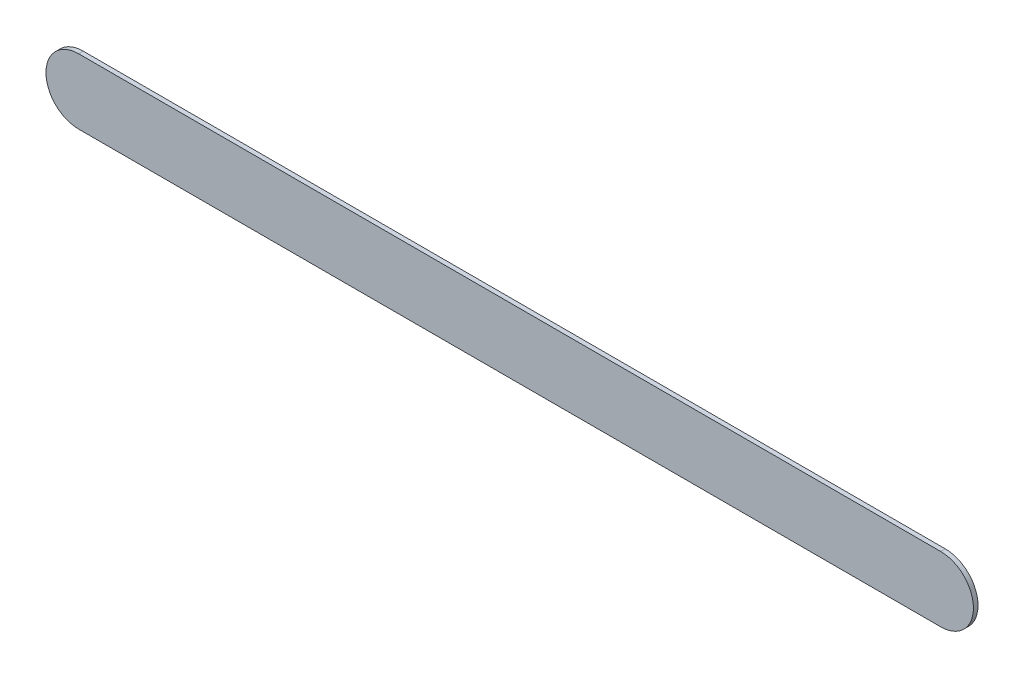
ISO-10303-21;
HEADER;
FILE_DESCRIPTION(('STEP AP214'),'2;1');
FILE_NAME('part.step','',(''),(''),'','','');
FILE_SCHEMA(('AUTOMOTIVE_DESIGN { 1 0 10303 214 1 1 1 1 }'));
ENDSEC;
DATA;
#1=APPLICATION_CONTEXT('core data for automotive mechanical design processes');
#2=APPLICATION_PROTOCOL_DEFINITION('international standard','automotive_design',2000,#1);
#3=PRODUCT_CONTEXT('',#1,'mechanical');
#4=PRODUCT('Part','Part','',(#3));
#5=PRODUCT_RELATED_PRODUCT_CATEGORY('part','',(#4));
#6=PRODUCT_DEFINITION_FORMATION('','',#4);
#7=PRODUCT_DEFINITION_CONTEXT('part definition',#1,'design');
#8=PRODUCT_DEFINITION('design','',#6,#7);
#9=PRODUCT_DEFINITION_SHAPE('','',#8);
#10=(LENGTH_UNIT() NAMED_UNIT(*) SI_UNIT(.MILLI.,.METRE.));
#11=(NAMED_UNIT(*) PLANE_ANGLE_UNIT() SI_UNIT($,.RADIAN.));
#12=(NAMED_UNIT(*) SI_UNIT($,.STERADIAN.) SOLID_ANGLE_UNIT());
#13=UNCERTAINTY_MEASURE_WITH_UNIT(LENGTH_MEASURE(1.E-05),#10,'distance_accuracy_value','');
#14=(GEOMETRIC_REPRESENTATION_CONTEXT(3) GLOBAL_UNCERTAINTY_ASSIGNED_CONTEXT((#13)) GLOBAL_UNIT_ASSIGNED_CONTEXT((#10,
#11,#12)) REPRESENTATION_CONTEXT('',''));
#15=CARTESIAN_POINT('',(0.,0.,0.));
#16=DIRECTION('',(0.,0.,1.));
#17=DIRECTION('',(1.,0.,0.));
#18=AXIS2_PLACEMENT_3D('',#15,#16,#17);
#19=CARTESIAN_POINT('',(131.064,-107.438,0.));
#20=DIRECTION('',(0.,0.,1.));
#21=DIRECTION('',(1.,0.,0.));
#22=AXIS2_PLACEMENT_3D('',#19,#20,#21);
#23=PLANE('',#22);
#24=DIRECTION('',(1.,0.,0.));
#25=VECTOR('',#24,1.);
#26=CARTESIAN_POINT('',(131.064,-107.438,0.));
#27=LINE('',#26,#25);
#28=CARTESIAN_POINT('',(131.064,-107.438,0.));
#29=VERTEX_POINT('',#28);
#30=CARTESIAN_POINT('',(137.668,-107.438,0.));
#31=VERTEX_POINT('',#30);
#32=EDGE_CURVE('E98',#29,#31,#27,.T.);
#33=ORIENTED_EDGE('',*,*,#32,.T.);
#34=CARTESIAN_POINT('',(137.668,-107.188,0.));
#35=DIRECTION('',(0.,0.,1.));
#36=DIRECTION('',(0.,-1.,0.));
#37=AXIS2_PLACEMENT_3D('',#34,#35,#36);
#38=CIRCLE('',#37,0.25);
#39=CARTESIAN_POINT('',(137.668,-106.938,0.));
#40=VERTEX_POINT('',#39);
#41=EDGE_CURVE('E78',#31,#40,#38,.T.);
#42=ORIENTED_EDGE('',*,*,#41,.T.);
#43=DIRECTION('',(-1.,0.,0.));
#44=VECTOR('',#43,1.);
#45=CARTESIAN_POINT('',(137.668,-106.938,0.));
#46=LINE('',#45,#44);
#47=CARTESIAN_POINT('',(131.064,-106.938,0.));
#48=VERTEX_POINT('',#47);
#49=EDGE_CURVE('E83',#40,#48,#46,.T.);
#50=ORIENTED_EDGE('',*,*,#49,.T.);
#51=CARTESIAN_POINT('',(131.064,-107.188,0.));
#52=DIRECTION('',(0.,0.,1.));
#53=DIRECTION('',(0.,1.,0.));
#54=AXIS2_PLACEMENT_3D('',#51,#52,#53);
#55=CIRCLE('',#54,0.25);
#56=EDGE_CURVE('E11',#48,#29,#55,.T.);
#57=ORIENTED_EDGE('',*,*,#56,.T.);
#58=EDGE_LOOP('',(#33,#42,#50,#57));
#59=FACE_BOUND('',#58,.T.);
#60=ADVANCED_FACE('F17',(#59),#23,.T.);
#61=CARTESIAN_POINT('',(131.064,-107.438,-0.035));
#62=DIRECTION('',(0.,0.,1.));
#63=DIRECTION('',(1.,0.,0.));
#64=AXIS2_PLACEMENT_3D('',#61,#62,#63);
#65=PLANE('',#64);
#66=CARTESIAN_POINT('',(131.064,-107.188,-0.035));
#67=DIRECTION('',(0.,0.,1.));
#68=DIRECTION('',(0.,1.,0.));
#69=AXIS2_PLACEMENT_3D('',#66,#67,#68);
#70=CIRCLE('',#69,0.25);
#71=CARTESIAN_POINT('',(131.064,-106.938,-0.035));
#72=VERTEX_POINT('',#71);
#73=CARTESIAN_POINT('',(131.064,-107.438,-0.035));
#74=VERTEX_POINT('',#73);
#75=EDGE_CURVE('E26',#72,#74,#70,.T.);
#76=ORIENTED_EDGE('',*,*,#75,.F.);
#77=DIRECTION('',(-1.,0.,0.));
#78=VECTOR('',#77,1.);
#79=CARTESIAN_POINT('',(137.668,-106.938,-0.035));
#80=LINE('',#79,#78);
#81=CARTESIAN_POINT('',(137.668,-106.938,-0.035));
#82=VERTEX_POINT('',#81);
#83=EDGE_CURVE('E69',#82,#72,#80,.T.);
#84=ORIENTED_EDGE('',*,*,#83,.F.);
#85=CARTESIAN_POINT('',(137.668,-107.188,-0.035));
#86=DIRECTION('',(0.,0.,1.));
#87=DIRECTION('',(0.,-1.,0.));
#88=AXIS2_PLACEMENT_3D('',#85,#86,#87);
#89=CIRCLE('',#88,0.25);
#90=CARTESIAN_POINT('',(137.668,-107.438,-0.035));
#91=VERTEX_POINT('',#90);
#92=EDGE_CURVE('E20',#91,#82,#89,.T.);
#93=ORIENTED_EDGE('',*,*,#92,.F.);
#94=DIRECTION('',(1.,0.,0.));
#95=VECTOR('',#94,1.);
#96=CARTESIAN_POINT('',(131.064,-107.438,-0.035));
#97=LINE('',#96,#95);
#98=EDGE_CURVE('E115',#74,#91,#97,.T.);
#99=ORIENTED_EDGE('',*,*,#98,.F.);
#100=EDGE_LOOP('',(#76,#84,#93,#99));
#101=FACE_BOUND('',#100,.T.);
#102=ADVANCED_FACE('F71',(#101),#65,.F.);
#103=CARTESIAN_POINT('',(131.064,-107.188,-0.035));
#104=DIRECTION('',(0.,0.,-1.));
#105=DIRECTION('',(0.,1.,0.));
#106=AXIS2_PLACEMENT_3D('',#103,#104,#105);
#107=CYLINDRICAL_SURFACE('',#106,0.25);
#108=ORIENTED_EDGE('',*,*,#75,.T.);
#109=DIRECTION('',(0.,0.,1.));
#110=VECTOR('',#109,1.);
#111=CARTESIAN_POINT('',(131.064,-107.438,-0.035));
#112=LINE('',#111,#110);
#113=EDGE_CURVE('E93',#74,#29,#112,.T.);
#114=ORIENTED_EDGE('',*,*,#113,.T.);
#115=ORIENTED_EDGE('',*,*,#56,.F.);
#116=DIRECTION('',(0.,0.,1.));
#117=VECTOR('',#116,1.);
#118=CARTESIAN_POINT('',(131.064,-106.938,-0.035));
#119=LINE('',#118,#117);
#120=EDGE_CURVE('E77',#72,#48,#119,.T.);
#121=ORIENTED_EDGE('',*,*,#120,.F.);
#122=EDGE_LOOP('',(#108,#114,#115,#121));
#123=FACE_BOUND('',#122,.T.);
#124=ADVANCED_FACE('F144',(#123),#107,.T.);
#125=CARTESIAN_POINT('',(137.668,-106.938,-0.035));
#126=DIRECTION('',(0.,-1.,0.));
#127=DIRECTION('',(0.,0.,-1.));
#128=AXIS2_PLACEMENT_3D('',#125,#126,#127);
#129=PLANE('',#128);
#130=ORIENTED_EDGE('',*,*,#83,.T.);
#131=ORIENTED_EDGE('',*,*,#120,.T.);
#132=ORIENTED_EDGE('',*,*,#49,.F.);
#133=DIRECTION('',(0.,0.,1.));
#134=VECTOR('',#133,1.);
#135=CARTESIAN_POINT('',(137.668,-106.938,-0.035));
#136=LINE('',#135,#134);
#137=EDGE_CURVE('E81',#82,#40,#136,.T.);
#138=ORIENTED_EDGE('',*,*,#137,.F.);
#139=EDGE_LOOP('',(#130,#131,#132,#138));
#140=FACE_BOUND('',#139,.T.);
#141=ADVANCED_FACE('F82',(#140),#129,.F.);
#142=CARTESIAN_POINT('',(137.668,-107.188,-0.035));
#143=DIRECTION('',(0.,0.,-1.));
#144=DIRECTION('',(0.,-1.,0.));
#145=AXIS2_PLACEMENT_3D('',#142,#143,#144);
#146=CYLINDRICAL_SURFACE('',#145,0.25);
#147=ORIENTED_EDGE('',*,*,#92,.T.);
#148=ORIENTED_EDGE('',*,*,#137,.T.);
#149=ORIENTED_EDGE('',*,*,#41,.F.);
#150=DIRECTION('',(0.,0.,1.));
#151=VECTOR('',#150,1.);
#152=CARTESIAN_POINT('',(137.668,-107.438,-0.035));
#153=LINE('',#152,#151);
#154=EDGE_CURVE('E90',#91,#31,#153,.T.);
#155=ORIENTED_EDGE('',*,*,#154,.F.);
#156=EDGE_LOOP('',(#147,#148,#149,#155));
#157=FACE_BOUND('',#156,.T.);
#158=ADVANCED_FACE('F88',(#157),#146,.T.);
#159=CARTESIAN_POINT('',(131.064,-107.438,-0.035));
#160=DIRECTION('',(0.,1.,0.));
#161=DIRECTION('',(1.,0.,0.));
#162=AXIS2_PLACEMENT_3D('',#159,#160,#161);
#163=PLANE('',#162);
#164=ORIENTED_EDGE('',*,*,#98,.T.);
#165=ORIENTED_EDGE('',*,*,#154,.T.);
#166=ORIENTED_EDGE('',*,*,#32,.F.);
#167=ORIENTED_EDGE('',*,*,#113,.F.);
#168=EDGE_LOOP('',(#164,#165,#166,#167));
#169=FACE_BOUND('',#168,.T.);
#170=ADVANCED_FACE('F114',(#169),#163,.F.);
#171=CLOSED_SHELL('',(#60,#102,#124,#141,#158,#170));
#172=MANIFOLD_SOLID_BREP('B1',#171);
#173=ADVANCED_BREP_SHAPE_REPRESENTATION('',(#18,#172),#14);
#174=SHAPE_DEFINITION_REPRESENTATION(#9,#173);
ENDSEC;
END-ISO-10303-21;
